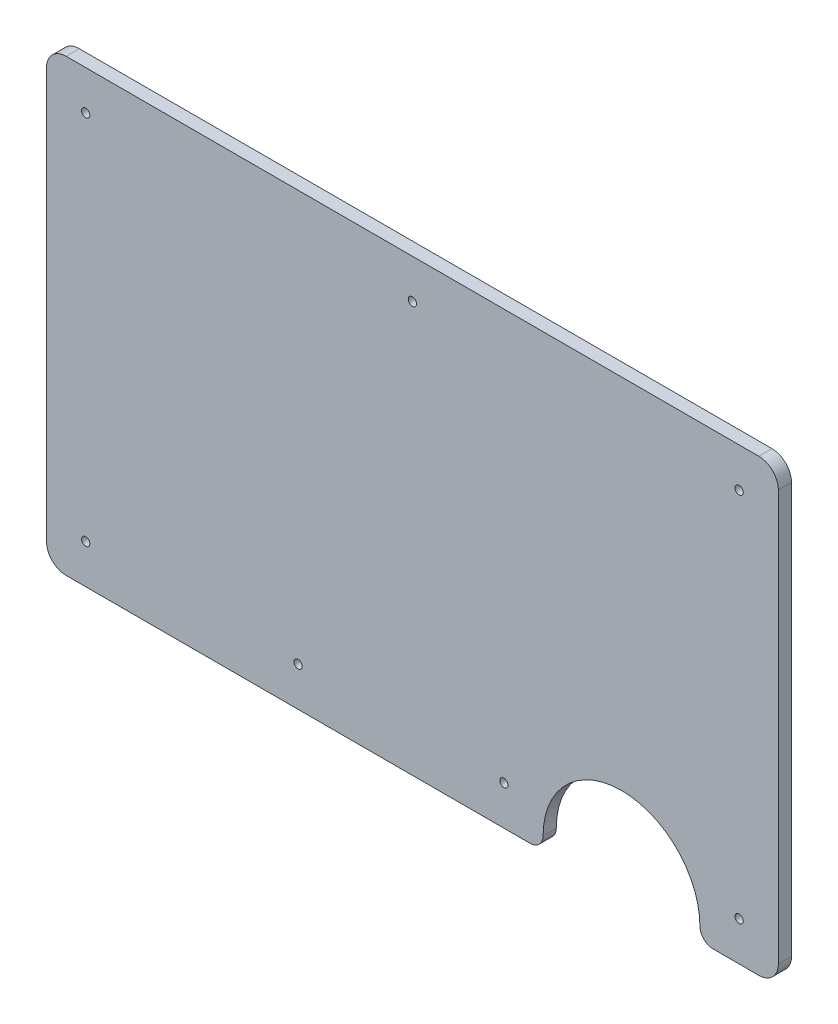
ISO-10303-21;
HEADER;
FILE_DESCRIPTION(('STEP AP214'),'2;1');
FILE_NAME('part.step','',(''),(''),'','','');
FILE_SCHEMA(('AUTOMOTIVE_DESIGN { 1 0 10303 214 1 1 1 1 }'));
ENDSEC;
DATA;
#1=APPLICATION_CONTEXT('core data for automotive mechanical design processes');
#2=APPLICATION_PROTOCOL_DEFINITION('international standard','automotive_design',2000,#1);
#3=PRODUCT_CONTEXT('',#1,'mechanical');
#4=PRODUCT('Part','Part','',(#3));
#5=PRODUCT_RELATED_PRODUCT_CATEGORY('part','',(#4));
#6=PRODUCT_DEFINITION_FORMATION('','',#4);
#7=PRODUCT_DEFINITION_CONTEXT('part definition',#1,'design');
#8=PRODUCT_DEFINITION('design','',#6,#7);
#9=PRODUCT_DEFINITION_SHAPE('','',#8);
#10=(LENGTH_UNIT() NAMED_UNIT(*) SI_UNIT(.MILLI.,.METRE.));
#11=(NAMED_UNIT(*) PLANE_ANGLE_UNIT() SI_UNIT($,.RADIAN.));
#12=(NAMED_UNIT(*) SI_UNIT($,.STERADIAN.) SOLID_ANGLE_UNIT());
#13=UNCERTAINTY_MEASURE_WITH_UNIT(LENGTH_MEASURE(1.E-05),#10,'distance_accuracy_value','');
#14=(GEOMETRIC_REPRESENTATION_CONTEXT(3) GLOBAL_UNCERTAINTY_ASSIGNED_CONTEXT((#13)) GLOBAL_UNIT_ASSIGNED_CONTEXT((#10,
#11,#12)) REPRESENTATION_CONTEXT('',''));
#15=CARTESIAN_POINT('',(0.,0.,0.));
#16=DIRECTION('',(0.,0.,1.));
#17=DIRECTION('',(1.,0.,0.));
#18=AXIS2_PLACEMENT_3D('',#15,#16,#17);
#19=CARTESIAN_POINT('',(2.38125,53.320743495935,0.));
#20=DIRECTION('',(0.,0.,1.));
#21=DIRECTION('',(1.,0.,0.));
#22=AXIS2_PLACEMENT_3D('',#19,#20,#21);
#23=CYLINDRICAL_SURFACE('',#22,2.38125);
#24=CARTESIAN_POINT('',(2.38125,53.320743495935,1.6));
#25=DIRECTION('',(0.,0.,1.));
#26=DIRECTION('',(1.,0.,0.));
#27=AXIS2_PLACEMENT_3D('',#24,#25,#26);
#28=CIRCLE('',#27,2.38125);
#29=CARTESIAN_POINT('',(2.38125,55.7019934959349,1.6));
#30=VERTEX_POINT('',#29);
#31=CARTESIAN_POINT('',(0.,53.320743495935,1.6));
#32=VERTEX_POINT('',#31);
#33=EDGE_CURVE('E157',#30,#32,#28,.T.);
#34=ORIENTED_EDGE('',*,*,#33,.F.);
#35=DIRECTION('',(0.,0.,1.));
#36=VECTOR('',#35,1.);
#37=CARTESIAN_POINT('',(2.38125,55.7019934959349,0.));
#38=LINE('',#37,#36);
#39=CARTESIAN_POINT('',(2.38125,55.7019934959349,0.));
#40=VERTEX_POINT('',#39);
#41=EDGE_CURVE('E11',#40,#30,#38,.T.);
#42=ORIENTED_EDGE('',*,*,#41,.F.);
#43=CARTESIAN_POINT('',(2.38125,53.320743495935,0.));
#44=DIRECTION('',(0.,0.,1.));
#45=DIRECTION('',(1.,0.,0.));
#46=AXIS2_PLACEMENT_3D('',#43,#44,#45);
#47=CIRCLE('',#46,2.38125);
#48=CARTESIAN_POINT('',(0.,53.320743495935,0.));
#49=VERTEX_POINT('',#48);
#50=EDGE_CURVE('E190',#40,#49,#47,.T.);
#51=ORIENTED_EDGE('',*,*,#50,.T.);
#52=DIRECTION('',(0.,0.,1.));
#53=VECTOR('',#52,1.);
#54=CARTESIAN_POINT('',(0.,53.320743495935,0.));
#55=LINE('',#54,#53);
#56=EDGE_CURVE('E39',#49,#32,#55,.T.);
#57=ORIENTED_EDGE('',*,*,#56,.T.);
#58=EDGE_LOOP('',(#34,#42,#51,#57));
#59=FACE_BOUND('',#58,.T.);
#60=ADVANCED_FACE('F36',(#59),#23,.T.);
#61=CARTESIAN_POINT('',(86.51875,55.7019934959349,0.));
#62=DIRECTION('',(0.,1.,0.));
#63=DIRECTION('',(0.,0.,1.));
#64=AXIS2_PLACEMENT_3D('',#61,#62,#63);
#65=PLANE('',#64);
#66=DIRECTION('',(-1.,0.,0.));
#67=VECTOR('',#66,1.);
#68=CARTESIAN_POINT('',(86.51875,55.7019934959349,1.6));
#69=LINE('',#68,#67);
#70=CARTESIAN_POINT('',(86.51875,55.7019934959349,1.6));
#71=VERTEX_POINT('',#70);
#72=EDGE_CURVE('E188',#71,#30,#69,.T.);
#73=ORIENTED_EDGE('',*,*,#72,.F.);
#74=DIRECTION('',(0.,0.,1.));
#75=VECTOR('',#74,1.);
#76=CARTESIAN_POINT('',(86.51875,55.7019934959349,0.));
#77=LINE('',#76,#75);
#78=CARTESIAN_POINT('',(86.51875,55.7019934959349,0.));
#79=VERTEX_POINT('',#78);
#80=EDGE_CURVE('E45',#79,#71,#77,.T.);
#81=ORIENTED_EDGE('',*,*,#80,.F.);
#82=DIRECTION('',(-1.,0.,0.));
#83=VECTOR('',#82,1.);
#84=CARTESIAN_POINT('',(86.51875,55.7019934959349,0.));
#85=LINE('',#84,#83);
#86=EDGE_CURVE('E147',#79,#40,#85,.T.);
#87=ORIENTED_EDGE('',*,*,#86,.T.);
#88=ORIENTED_EDGE('',*,*,#41,.T.);
#89=EDGE_LOOP('',(#73,#81,#87,#88));
#90=FACE_BOUND('',#89,.T.);
#91=ADVANCED_FACE('F210',(#90),#65,.T.);
#92=CARTESIAN_POINT('',(86.51875,53.320743495935,0.));
#93=DIRECTION('',(0.,0.,1.));
#94=DIRECTION('',(1.,0.,0.));
#95=AXIS2_PLACEMENT_3D('',#92,#93,#94);
#96=CYLINDRICAL_SURFACE('',#95,2.38125);
#97=CARTESIAN_POINT('',(86.51875,53.320743495935,1.6));
#98=DIRECTION('',(0.,0.,1.));
#99=DIRECTION('',(1.,0.,0.));
#100=AXIS2_PLACEMENT_3D('',#97,#98,#99);
#101=CIRCLE('',#100,2.38125);
#102=CARTESIAN_POINT('',(88.9,53.320743495935,1.6));
#103=VERTEX_POINT('',#102);
#104=EDGE_CURVE('E134',#103,#71,#101,.T.);
#105=ORIENTED_EDGE('',*,*,#104,.F.);
#106=DIRECTION('',(0.,0.,1.));
#107=VECTOR('',#106,1.);
#108=CARTESIAN_POINT('',(88.9,53.320743495935,0.));
#109=LINE('',#108,#107);
#110=CARTESIAN_POINT('',(88.9,53.320743495935,0.));
#111=VERTEX_POINT('',#110);
#112=EDGE_CURVE('E129',#111,#103,#109,.T.);
#113=ORIENTED_EDGE('',*,*,#112,.F.);
#114=CARTESIAN_POINT('',(86.51875,53.320743495935,0.));
#115=DIRECTION('',(0.,0.,1.));
#116=DIRECTION('',(1.,0.,0.));
#117=AXIS2_PLACEMENT_3D('',#114,#115,#116);
#118=CIRCLE('',#117,2.38125);
#119=EDGE_CURVE('E132',#111,#79,#118,.T.);
#120=ORIENTED_EDGE('',*,*,#119,.T.);
#121=ORIENTED_EDGE('',*,*,#80,.T.);
#122=EDGE_LOOP('',(#105,#113,#120,#121));
#123=FACE_BOUND('',#122,.T.);
#124=ADVANCED_FACE('F131',(#123),#96,.T.);
#125=CARTESIAN_POINT('',(88.9,3.47324349593496,0.));
#126=DIRECTION('',(1.,0.,0.));
#127=DIRECTION('',(0.,0.,-1.));
#128=AXIS2_PLACEMENT_3D('',#125,#126,#127);
#129=PLANE('',#128);
#130=DIRECTION('',(0.,1.,0.));
#131=VECTOR('',#130,1.);
#132=CARTESIAN_POINT('',(88.9,3.47324349593496,1.6));
#133=LINE('',#132,#131);
#134=CARTESIAN_POINT('',(88.9,3.47324349593496,1.6));
#135=VERTEX_POINT('',#134);
#136=EDGE_CURVE('E185',#135,#103,#133,.T.);
#137=ORIENTED_EDGE('',*,*,#136,.F.);
#138=DIRECTION('',(0.,0.,1.));
#139=VECTOR('',#138,1.);
#140=CARTESIAN_POINT('',(88.9,3.47324349593496,0.));
#141=LINE('',#140,#139);
#142=CARTESIAN_POINT('',(88.9,3.47324349593496,0.));
#143=VERTEX_POINT('',#142);
#144=EDGE_CURVE('E139',#143,#135,#141,.T.);
#145=ORIENTED_EDGE('',*,*,#144,.F.);
#146=DIRECTION('',(0.,1.,0.));
#147=VECTOR('',#146,1.);
#148=CARTESIAN_POINT('',(88.9,3.47324349593496,0.));
#149=LINE('',#148,#147);
#150=EDGE_CURVE('E145',#143,#111,#149,.T.);
#151=ORIENTED_EDGE('',*,*,#150,.T.);
#152=ORIENTED_EDGE('',*,*,#112,.T.);
#153=EDGE_LOOP('',(#137,#145,#151,#152));
#154=FACE_BOUND('',#153,.T.);
#155=ADVANCED_FACE('F149',(#154),#129,.T.);
#156=CARTESIAN_POINT('',(86.51875,3.47324349593496,0.));
#157=DIRECTION('',(0.,0.,1.));
#158=DIRECTION('',(1.,0.,0.));
#159=AXIS2_PLACEMENT_3D('',#156,#157,#158);
#160=CYLINDRICAL_SURFACE('',#159,2.38125);
#161=CARTESIAN_POINT('',(86.51875,3.47324349593496,1.6));
#162=DIRECTION('',(0.,0.,1.));
#163=DIRECTION('',(1.,0.,0.));
#164=AXIS2_PLACEMENT_3D('',#161,#162,#163);
#165=CIRCLE('',#164,2.38125);
#166=CARTESIAN_POINT('',(86.51875,1.09199349593496,1.6));
#167=VERTEX_POINT('',#166);
#168=EDGE_CURVE('E182',#167,#135,#165,.T.);
#169=ORIENTED_EDGE('',*,*,#168,.F.);
#170=DIRECTION('',(0.,0.,1.));
#171=VECTOR('',#170,1.);
#172=CARTESIAN_POINT('',(86.51875,1.09199349593496,0.));
#173=LINE('',#172,#171);
#174=CARTESIAN_POINT('',(86.51875,1.09199349593496,0.));
#175=VERTEX_POINT('',#174);
#176=EDGE_CURVE('E194',#175,#167,#173,.T.);
#177=ORIENTED_EDGE('',*,*,#176,.F.);
#178=CARTESIAN_POINT('',(86.51875,3.47324349593496,0.));
#179=DIRECTION('',(0.,0.,1.));
#180=DIRECTION('',(1.,0.,0.));
#181=AXIS2_PLACEMENT_3D('',#178,#179,#180);
#182=CIRCLE('',#181,2.38125);
#183=EDGE_CURVE('E150',#175,#143,#182,.T.);
#184=ORIENTED_EDGE('',*,*,#183,.T.);
#185=ORIENTED_EDGE('',*,*,#144,.T.);
#186=EDGE_LOOP('',(#169,#177,#184,#185));
#187=FACE_BOUND('',#186,.T.);
#188=ADVANCED_FACE('F223',(#187),#160,.T.);
#189=CARTESIAN_POINT('',(80.9625,1.09199349593496,0.));
#190=DIRECTION('',(0.,-1.,0.));
#191=DIRECTION('',(0.,0.,-1.));
#192=AXIS2_PLACEMENT_3D('',#189,#190,#191);
#193=PLANE('',#192);
#194=DIRECTION('',(1.,0.,0.));
#195=VECTOR('',#194,1.);
#196=CARTESIAN_POINT('',(80.9625,1.09199349593496,1.6));
#197=LINE('',#196,#195);
#198=CARTESIAN_POINT('',(80.9625,1.09199349593496,1.6));
#199=VERTEX_POINT('',#198);
#200=EDGE_CURVE('E179',#199,#167,#197,.T.);
#201=ORIENTED_EDGE('',*,*,#200,.F.);
#202=DIRECTION('',(0.,0.,1.));
#203=VECTOR('',#202,1.);
#204=CARTESIAN_POINT('',(80.9625,1.09199349593496,0.));
#205=LINE('',#204,#203);
#206=CARTESIAN_POINT('',(80.9625,1.09199349593496,0.));
#207=VERTEX_POINT('',#206);
#208=EDGE_CURVE('E196',#207,#199,#205,.T.);
#209=ORIENTED_EDGE('',*,*,#208,.F.);
#210=DIRECTION('',(1.,0.,0.));
#211=VECTOR('',#210,1.);
#212=CARTESIAN_POINT('',(80.9625,1.09199349593496,0.));
#213=LINE('',#212,#211);
#214=EDGE_CURVE('E152',#207,#175,#213,.T.);
#215=ORIENTED_EDGE('',*,*,#214,.T.);
#216=ORIENTED_EDGE('',*,*,#176,.T.);
#217=EDGE_LOOP('',(#201,#209,#215,#216));
#218=FACE_BOUND('',#217,.T.);
#219=ADVANCED_FACE('F226',(#218),#193,.T.);
#220=CARTESIAN_POINT('',(80.9625,2.67949349593496,0.));
#221=DIRECTION('',(0.,0.,1.));
#222=DIRECTION('',(1.,0.,0.));
#223=AXIS2_PLACEMENT_3D('',#220,#221,#222);
#224=CYLINDRICAL_SURFACE('',#223,1.5875);
#225=CARTESIAN_POINT('',(80.9625,2.67949349593496,1.6));
#226=DIRECTION('',(0.,0.,1.));
#227=DIRECTION('',(1.,0.,0.));
#228=AXIS2_PLACEMENT_3D('',#225,#226,#227);
#229=CIRCLE('',#228,1.5875);
#230=CARTESIAN_POINT('',(79.375,2.67949349593496,1.6));
#231=VERTEX_POINT('',#230);
#232=EDGE_CURVE('E176',#231,#199,#229,.T.);
#233=ORIENTED_EDGE('',*,*,#232,.F.);
#234=DIRECTION('',(0.,0.,1.));
#235=VECTOR('',#234,1.);
#236=CARTESIAN_POINT('',(79.375,2.67949349593496,0.));
#237=LINE('',#236,#235);
#238=CARTESIAN_POINT('',(79.375,2.67949349593496,0.));
#239=VERTEX_POINT('',#238);
#240=EDGE_CURVE('E198',#239,#231,#237,.T.);
#241=ORIENTED_EDGE('',*,*,#240,.F.);
#242=CARTESIAN_POINT('',(80.9625,2.67949349593496,0.));
#243=DIRECTION('',(0.,0.,1.));
#244=DIRECTION('',(1.,0.,0.));
#245=AXIS2_PLACEMENT_3D('',#242,#243,#244);
#246=CIRCLE('',#245,1.5875);
#247=EDGE_CURVE('E350',#239,#207,#246,.T.);
#248=ORIENTED_EDGE('',*,*,#247,.T.);
#249=ORIENTED_EDGE('',*,*,#208,.T.);
#250=EDGE_LOOP('',(#233,#241,#248,#249));
#251=FACE_BOUND('',#250,.T.);
#252=ADVANCED_FACE('F230',(#251),#224,.T.);
#253=CARTESIAN_POINT('',(69.85,2.67949349593496,0.));
#254=DIRECTION('',(0.,0.,1.));
#255=DIRECTION('',(1.,0.,0.));
#256=AXIS2_PLACEMENT_3D('',#253,#254,#255);
#257=CYLINDRICAL_SURFACE('',#256,9.525);
#258=CARTESIAN_POINT('',(69.85,2.67949349593496,1.6));
#259=DIRECTION('',(0.,0.,-1.));
#260=DIRECTION('',(-1.,0.,0.));
#261=AXIS2_PLACEMENT_3D('',#258,#259,#260);
#262=CIRCLE('',#261,9.525);
#263=CARTESIAN_POINT('',(60.325,2.67949349593496,1.6));
#264=VERTEX_POINT('',#263);
#265=EDGE_CURVE('E173',#264,#231,#262,.T.);
#266=ORIENTED_EDGE('',*,*,#265,.F.);
#267=DIRECTION('',(0.,0.,1.));
#268=VECTOR('',#267,1.);
#269=CARTESIAN_POINT('',(60.325,2.67949349593496,0.));
#270=LINE('',#269,#268);
#271=CARTESIAN_POINT('',(60.325,2.67949349593496,0.));
#272=VERTEX_POINT('',#271);
#273=EDGE_CURVE('E200',#272,#264,#270,.T.);
#274=ORIENTED_EDGE('',*,*,#273,.F.);
#275=CARTESIAN_POINT('',(69.85,2.67949349593496,0.));
#276=DIRECTION('',(0.,0.,-1.));
#277=DIRECTION('',(-1.,0.,0.));
#278=AXIS2_PLACEMENT_3D('',#275,#276,#277);
#279=CIRCLE('',#278,9.525);
#280=EDGE_CURVE('E347',#272,#239,#279,.T.);
#281=ORIENTED_EDGE('',*,*,#280,.T.);
#282=ORIENTED_EDGE('',*,*,#240,.T.);
#283=EDGE_LOOP('',(#266,#274,#281,#282));
#284=FACE_BOUND('',#283,.T.);
#285=ADVANCED_FACE('F234',(#284),#257,.F.);
#286=CARTESIAN_POINT('',(58.7375,2.67949349593496,0.));
#287=DIRECTION('',(0.,0.,1.));
#288=DIRECTION('',(1.,0.,0.));
#289=AXIS2_PLACEMENT_3D('',#286,#287,#288);
#290=CYLINDRICAL_SURFACE('',#289,1.5875);
#291=CARTESIAN_POINT('',(58.7375,2.67949349593496,1.6));
#292=DIRECTION('',(0.,0.,1.));
#293=DIRECTION('',(1.,0.,0.));
#294=AXIS2_PLACEMENT_3D('',#291,#292,#293);
#295=CIRCLE('',#294,1.5875);
#296=CARTESIAN_POINT('',(58.7375,1.09199349593496,1.6));
#297=VERTEX_POINT('',#296);
#298=EDGE_CURVE('E170',#297,#264,#295,.T.);
#299=ORIENTED_EDGE('',*,*,#298,.F.);
#300=DIRECTION('',(0.,0.,1.));
#301=VECTOR('',#300,1.);
#302=CARTESIAN_POINT('',(58.7375,1.09199349593496,0.));
#303=LINE('',#302,#301);
#304=CARTESIAN_POINT('',(58.7375,1.09199349593496,0.));
#305=VERTEX_POINT('',#304);
#306=EDGE_CURVE('E202',#305,#297,#303,.T.);
#307=ORIENTED_EDGE('',*,*,#306,.F.);
#308=CARTESIAN_POINT('',(58.7375,2.67949349593496,0.));
#309=DIRECTION('',(0.,0.,1.));
#310=DIRECTION('',(1.,0.,0.));
#311=AXIS2_PLACEMENT_3D('',#308,#309,#310);
#312=CIRCLE('',#311,1.5875);
#313=EDGE_CURVE('E344',#305,#272,#312,.T.);
#314=ORIENTED_EDGE('',*,*,#313,.T.);
#315=ORIENTED_EDGE('',*,*,#273,.T.);
#316=EDGE_LOOP('',(#299,#307,#314,#315));
#317=FACE_BOUND('',#316,.T.);
#318=ADVANCED_FACE('F238',(#317),#290,.T.);
#319=CARTESIAN_POINT('',(2.38125,1.09199349593496,0.));
#320=DIRECTION('',(0.,-1.,0.));
#321=DIRECTION('',(0.,0.,-1.));
#322=AXIS2_PLACEMENT_3D('',#319,#320,#321);
#323=PLANE('',#322);
#324=DIRECTION('',(1.,0.,0.));
#325=VECTOR('',#324,1.);
#326=CARTESIAN_POINT('',(2.38125,1.09199349593496,1.6));
#327=LINE('',#326,#325);
#328=CARTESIAN_POINT('',(2.38125,1.09199349593496,1.6));
#329=VERTEX_POINT('',#328);
#330=EDGE_CURVE('E167',#329,#297,#327,.T.);
#331=ORIENTED_EDGE('',*,*,#330,.F.);
#332=DIRECTION('',(0.,0.,1.));
#333=VECTOR('',#332,1.);
#334=CARTESIAN_POINT('',(2.38125,1.09199349593496,0.));
#335=LINE('',#334,#333);
#336=CARTESIAN_POINT('',(2.38125,1.09199349593496,0.));
#337=VERTEX_POINT('',#336);
#338=EDGE_CURVE('E204',#337,#329,#335,.T.);
#339=ORIENTED_EDGE('',*,*,#338,.F.);
#340=DIRECTION('',(1.,0.,0.));
#341=VECTOR('',#340,1.);
#342=CARTESIAN_POINT('',(2.38125,1.09199349593496,0.));
#343=LINE('',#342,#341);
#344=EDGE_CURVE('E341',#337,#305,#343,.T.);
#345=ORIENTED_EDGE('',*,*,#344,.T.);
#346=ORIENTED_EDGE('',*,*,#306,.T.);
#347=EDGE_LOOP('',(#331,#339,#345,#346));
#348=FACE_BOUND('',#347,.T.);
#349=ADVANCED_FACE('F242',(#348),#323,.T.);
#350=CARTESIAN_POINT('',(2.38125,3.47324349593496,0.));
#351=DIRECTION('',(0.,0.,1.));
#352=DIRECTION('',(1.,0.,0.));
#353=AXIS2_PLACEMENT_3D('',#350,#351,#352);
#354=CYLINDRICAL_SURFACE('',#353,2.38125);
#355=CARTESIAN_POINT('',(2.38125,3.47324349593496,1.6));
#356=DIRECTION('',(0.,0.,1.));
#357=DIRECTION('',(1.,0.,0.));
#358=AXIS2_PLACEMENT_3D('',#355,#356,#357);
#359=CIRCLE('',#358,2.38125);
#360=CARTESIAN_POINT('',(0.,3.47324349593496,1.6));
#361=VERTEX_POINT('',#360);
#362=EDGE_CURVE('E164',#361,#329,#359,.T.);
#363=ORIENTED_EDGE('',*,*,#362,.F.);
#364=DIRECTION('',(0.,0.,1.));
#365=VECTOR('',#364,1.);
#366=CARTESIAN_POINT('',(0.,3.47324349593496,0.));
#367=LINE('',#366,#365);
#368=CARTESIAN_POINT('',(0.,3.47324349593496,0.));
#369=VERTEX_POINT('',#368);
#370=EDGE_CURVE('E205',#369,#361,#367,.T.);
#371=ORIENTED_EDGE('',*,*,#370,.F.);
#372=CARTESIAN_POINT('',(2.38125,3.47324349593496,0.));
#373=DIRECTION('',(0.,0.,1.));
#374=DIRECTION('',(1.,0.,0.));
#375=AXIS2_PLACEMENT_3D('',#372,#373,#374);
#376=CIRCLE('',#375,2.38125);
#377=EDGE_CURVE('E338',#369,#337,#376,.T.);
#378=ORIENTED_EDGE('',*,*,#377,.T.);
#379=ORIENTED_EDGE('',*,*,#338,.T.);
#380=EDGE_LOOP('',(#363,#371,#378,#379));
#381=FACE_BOUND('',#380,.T.);
#382=ADVANCED_FACE('F246',(#381),#354,.T.);
#383=CARTESIAN_POINT('',(0.,53.320743495935,0.));
#384=DIRECTION('',(-1.,0.,0.));
#385=DIRECTION('',(0.,0.,1.));
#386=AXIS2_PLACEMENT_3D('',#383,#384,#385);
#387=PLANE('',#386);
#388=DIRECTION('',(0.,-1.,0.));
#389=VECTOR('',#388,1.);
#390=CARTESIAN_POINT('',(0.,53.320743495935,1.6));
#391=LINE('',#390,#389);
#392=EDGE_CURVE('E160',#32,#361,#391,.T.);
#393=ORIENTED_EDGE('',*,*,#392,.F.);
#394=ORIENTED_EDGE('',*,*,#56,.F.);
#395=DIRECTION('',(0.,-1.,0.));
#396=VECTOR('',#395,1.);
#397=CARTESIAN_POINT('',(0.,53.320743495935,0.));
#398=LINE('',#397,#396);
#399=EDGE_CURVE('E336',#49,#369,#398,.T.);
#400=ORIENTED_EDGE('',*,*,#399,.T.);
#401=ORIENTED_EDGE('',*,*,#370,.T.);
#402=EDGE_LOOP('',(#393,#394,#400,#401));
#403=FACE_BOUND('',#402,.T.);
#404=ADVANCED_FACE('F207',(#403),#387,.T.);
#405=CARTESIAN_POINT('',(2.38125,53.320743495935,0.));
#406=DIRECTION('',(0.,0.,1.));
#407=DIRECTION('',(1.,0.,0.));
#408=AXIS2_PLACEMENT_3D('',#405,#406,#407);
#409=PLANE('',#408);
#410=CARTESIAN_POINT('',(44.45,50.9394934959349,0.));
#411=DIRECTION('',(0.,0.,1.));
#412=DIRECTION('',(-1.,0.,0.));
#413=AXIS2_PLACEMENT_3D('',#410,#411,#412);
#414=CIRCLE('',#413,0.499999999999999);
#415=CARTESIAN_POINT('',(43.95,50.9394934959349,0.));
#416=VERTEX_POINT('',#415);
#417=EDGE_CURVE('E293',#416,#416,#414,.T.);
#418=ORIENTED_EDGE('',*,*,#417,.T.);
#419=EDGE_LOOP('',(#418));
#420=FACE_BOUND('',#419,.T.);
#421=CARTESIAN_POINT('',(55.5625,5.85449349593496,0.));
#422=DIRECTION('',(0.,0.,1.));
#423=DIRECTION('',(-1.,0.,0.));
#424=AXIS2_PLACEMENT_3D('',#421,#422,#423);
#425=CIRCLE('',#424,0.499999999999999);
#426=CARTESIAN_POINT('',(55.0625,5.85449349593496,0.));
#427=VERTEX_POINT('',#426);
#428=EDGE_CURVE('E301',#427,#427,#425,.T.);
#429=ORIENTED_EDGE('',*,*,#428,.T.);
#430=EDGE_LOOP('',(#429));
#431=FACE_BOUND('',#430,.T.);
#432=CARTESIAN_POINT('',(30.559375,5.85449349593495,0.));
#433=DIRECTION('',(0.,0.,1.));
#434=DIRECTION('',(-1.,0.,0.));
#435=AXIS2_PLACEMENT_3D('',#432,#433,#434);
#436=CIRCLE('',#435,0.499999999999999);
#437=CARTESIAN_POINT('',(30.059375,5.85449349593495,0.));
#438=VERTEX_POINT('',#437);
#439=EDGE_CURVE('E307',#438,#438,#436,.T.);
#440=ORIENTED_EDGE('',*,*,#439,.T.);
#441=EDGE_LOOP('',(#440));
#442=FACE_BOUND('',#441,.T.);
#443=CARTESIAN_POINT('',(84.1375,50.9394934959349,0.));
#444=DIRECTION('',(0.,0.,1.));
#445=DIRECTION('',(-1.,0.,0.));
#446=AXIS2_PLACEMENT_3D('',#443,#444,#445);
#447=CIRCLE('',#446,0.499999999999999);
#448=CARTESIAN_POINT('',(83.6375,50.9394934959349,0.));
#449=VERTEX_POINT('',#448);
#450=EDGE_CURVE('E313',#449,#449,#447,.T.);
#451=ORIENTED_EDGE('',*,*,#450,.T.);
#452=EDGE_LOOP('',(#451));
#453=FACE_BOUND('',#452,.T.);
#454=CARTESIAN_POINT('',(84.1375,5.85449349593496,0.));
#455=DIRECTION('',(0.,0.,1.));
#456=DIRECTION('',(-1.,0.,0.));
#457=AXIS2_PLACEMENT_3D('',#454,#455,#456);
#458=CIRCLE('',#457,0.499999999999999);
#459=CARTESIAN_POINT('',(83.6375,5.85449349593496,0.));
#460=VERTEX_POINT('',#459);
#461=EDGE_CURVE('E319',#460,#460,#458,.T.);
#462=ORIENTED_EDGE('',*,*,#461,.T.);
#463=EDGE_LOOP('',(#462));
#464=FACE_BOUND('',#463,.T.);
#465=CARTESIAN_POINT('',(4.7625,5.85449349593496,0.));
#466=DIRECTION('',(0.,0.,1.));
#467=DIRECTION('',(-1.,0.,0.));
#468=AXIS2_PLACEMENT_3D('',#465,#466,#467);
#469=CIRCLE('',#468,0.5);
#470=CARTESIAN_POINT('',(4.2625,5.85449349593496,0.));
#471=VERTEX_POINT('',#470);
#472=EDGE_CURVE('E325',#471,#471,#469,.T.);
#473=ORIENTED_EDGE('',*,*,#472,.T.);
#474=EDGE_LOOP('',(#473));
#475=FACE_BOUND('',#474,.T.);
#476=CARTESIAN_POINT('',(4.7625,50.9394934959349,0.));
#477=DIRECTION('',(0.,0.,1.));
#478=DIRECTION('',(-1.,0.,0.));
#479=AXIS2_PLACEMENT_3D('',#476,#477,#478);
#480=CIRCLE('',#479,0.5);
#481=CARTESIAN_POINT('',(4.2625,50.9394934959349,0.));
#482=VERTEX_POINT('',#481);
#483=EDGE_CURVE('E161',#482,#482,#480,.T.);
#484=ORIENTED_EDGE('',*,*,#483,.T.);
#485=EDGE_LOOP('',(#484));
#486=FACE_BOUND('',#485,.T.);
#487=ORIENTED_EDGE('',*,*,#50,.F.);
#488=ORIENTED_EDGE('',*,*,#86,.F.);
#489=ORIENTED_EDGE('',*,*,#119,.F.);
#490=ORIENTED_EDGE('',*,*,#150,.F.);
#491=ORIENTED_EDGE('',*,*,#183,.F.);
#492=ORIENTED_EDGE('',*,*,#214,.F.);
#493=ORIENTED_EDGE('',*,*,#247,.F.);
#494=ORIENTED_EDGE('',*,*,#280,.F.);
#495=ORIENTED_EDGE('',*,*,#313,.F.);
#496=ORIENTED_EDGE('',*,*,#344,.F.);
#497=ORIENTED_EDGE('',*,*,#377,.F.);
#498=ORIENTED_EDGE('',*,*,#399,.F.);
#499=EDGE_LOOP('',(#487,#488,#489,#490,#491,#492,#493,#494,#495,#496,#497,#498));
#500=FACE_BOUND('',#499,.T.);
#501=ADVANCED_FACE('F143',(#420,#431,#442,#453,#464,#475,#486,#500),#409,.F.);
#502=CARTESIAN_POINT('',(2.38125,53.320743495935,1.6));
#503=DIRECTION('',(0.,0.,1.));
#504=DIRECTION('',(1.,0.,0.));
#505=AXIS2_PLACEMENT_3D('',#502,#503,#504);
#506=PLANE('',#505);
#507=CARTESIAN_POINT('',(44.45,50.9394934959349,1.6));
#508=DIRECTION('',(0.,0.,1.));
#509=DIRECTION('',(-1.,0.,0.));
#510=AXIS2_PLACEMENT_3D('',#507,#508,#509);
#511=CIRCLE('',#510,0.499999999999999);
#512=CARTESIAN_POINT('',(43.95,50.9394934959349,1.6));
#513=VERTEX_POINT('',#512);
#514=EDGE_CURVE('E296',#513,#513,#511,.T.);
#515=ORIENTED_EDGE('',*,*,#514,.F.);
#516=EDGE_LOOP('',(#515));
#517=FACE_BOUND('',#516,.T.);
#518=CARTESIAN_POINT('',(55.5625,5.85449349593496,1.6));
#519=DIRECTION('',(0.,0.,1.));
#520=DIRECTION('',(-1.,0.,0.));
#521=AXIS2_PLACEMENT_3D('',#518,#519,#520);
#522=CIRCLE('',#521,0.499999999999999);
#523=CARTESIAN_POINT('',(55.0625,5.85449349593496,1.6));
#524=VERTEX_POINT('',#523);
#525=EDGE_CURVE('E298',#524,#524,#522,.T.);
#526=ORIENTED_EDGE('',*,*,#525,.F.);
#527=EDGE_LOOP('',(#526));
#528=FACE_BOUND('',#527,.T.);
#529=CARTESIAN_POINT('',(30.559375,5.85449349593495,1.6));
#530=DIRECTION('',(0.,0.,1.));
#531=DIRECTION('',(-1.,0.,0.));
#532=AXIS2_PLACEMENT_3D('',#529,#530,#531);
#533=CIRCLE('',#532,0.499999999999999);
#534=CARTESIAN_POINT('',(30.059375,5.85449349593495,1.6));
#535=VERTEX_POINT('',#534);
#536=EDGE_CURVE('E304',#535,#535,#533,.T.);
#537=ORIENTED_EDGE('',*,*,#536,.F.);
#538=EDGE_LOOP('',(#537));
#539=FACE_BOUND('',#538,.T.);
#540=CARTESIAN_POINT('',(84.1375,50.9394934959349,1.6));
#541=DIRECTION('',(0.,0.,1.));
#542=DIRECTION('',(-1.,0.,0.));
#543=AXIS2_PLACEMENT_3D('',#540,#541,#542);
#544=CIRCLE('',#543,0.499999999999999);
#545=CARTESIAN_POINT('',(83.6375,50.9394934959349,1.6));
#546=VERTEX_POINT('',#545);
#547=EDGE_CURVE('E310',#546,#546,#544,.T.);
#548=ORIENTED_EDGE('',*,*,#547,.F.);
#549=EDGE_LOOP('',(#548));
#550=FACE_BOUND('',#549,.T.);
#551=CARTESIAN_POINT('',(84.1375,5.85449349593496,1.6));
#552=DIRECTION('',(0.,0.,1.));
#553=DIRECTION('',(-1.,0.,0.));
#554=AXIS2_PLACEMENT_3D('',#551,#552,#553);
#555=CIRCLE('',#554,0.499999999999999);
#556=CARTESIAN_POINT('',(83.6375,5.85449349593496,1.6));
#557=VERTEX_POINT('',#556);
#558=EDGE_CURVE('E316',#557,#557,#555,.T.);
#559=ORIENTED_EDGE('',*,*,#558,.F.);
#560=EDGE_LOOP('',(#559));
#561=FACE_BOUND('',#560,.T.);
#562=CARTESIAN_POINT('',(4.7625,5.85449349593496,1.6));
#563=DIRECTION('',(0.,0.,1.));
#564=DIRECTION('',(-1.,0.,0.));
#565=AXIS2_PLACEMENT_3D('',#562,#563,#564);
#566=CIRCLE('',#565,0.5);
#567=CARTESIAN_POINT('',(4.2625,5.85449349593496,1.6));
#568=VERTEX_POINT('',#567);
#569=EDGE_CURVE('E322',#568,#568,#566,.T.);
#570=ORIENTED_EDGE('',*,*,#569,.F.);
#571=EDGE_LOOP('',(#570));
#572=FACE_BOUND('',#571,.T.);
#573=CARTESIAN_POINT('',(4.7625,50.9394934959349,1.6));
#574=DIRECTION('',(0.,0.,1.));
#575=DIRECTION('',(-1.,0.,0.));
#576=AXIS2_PLACEMENT_3D('',#573,#574,#575);
#577=CIRCLE('',#576,0.5);
#578=CARTESIAN_POINT('',(4.2625,50.9394934959349,1.6));
#579=VERTEX_POINT('',#578);
#580=EDGE_CURVE('E328',#579,#579,#577,.T.);
#581=ORIENTED_EDGE('',*,*,#580,.F.);
#582=EDGE_LOOP('',(#581));
#583=FACE_BOUND('',#582,.T.);
#584=ORIENTED_EDGE('',*,*,#33,.T.);
#585=ORIENTED_EDGE('',*,*,#392,.T.);
#586=ORIENTED_EDGE('',*,*,#362,.T.);
#587=ORIENTED_EDGE('',*,*,#330,.T.);
#588=ORIENTED_EDGE('',*,*,#298,.T.);
#589=ORIENTED_EDGE('',*,*,#265,.T.);
#590=ORIENTED_EDGE('',*,*,#232,.T.);
#591=ORIENTED_EDGE('',*,*,#200,.T.);
#592=ORIENTED_EDGE('',*,*,#168,.T.);
#593=ORIENTED_EDGE('',*,*,#136,.T.);
#594=ORIENTED_EDGE('',*,*,#104,.T.);
#595=ORIENTED_EDGE('',*,*,#72,.T.);
#596=EDGE_LOOP('',(#584,#585,#586,#587,#588,#589,#590,#591,#592,#593,#594,#595));
#597=FACE_BOUND('',#596,.T.);
#598=ADVANCED_FACE('F209',(#517,#528,#539,#550,#561,#572,#583,#597),#506,.T.);
#599=CARTESIAN_POINT('',(4.7625,50.9394934959349,0.));
#600=DIRECTION('',(0.,0.,1.));
#601=DIRECTION('',(1.,0.,0.));
#602=AXIS2_PLACEMENT_3D('',#599,#600,#601);
#603=CYLINDRICAL_SURFACE('',#602,0.5);
#604=ORIENTED_EDGE('',*,*,#483,.F.);
#605=EDGE_LOOP('',(#604));
#606=FACE_BOUND('',#605,.T.);
#607=ORIENTED_EDGE('',*,*,#580,.T.);
#608=EDGE_LOOP('',(#607));
#609=FACE_BOUND('',#608,.T.);
#610=ADVANCED_FACE('F258',(#606,#609),#603,.F.);
#611=CARTESIAN_POINT('',(4.7625,5.85449349593496,0.));
#612=DIRECTION('',(0.,0.,1.));
#613=DIRECTION('',(1.,0.,0.));
#614=AXIS2_PLACEMENT_3D('',#611,#612,#613);
#615=CYLINDRICAL_SURFACE('',#614,0.5);
#616=ORIENTED_EDGE('',*,*,#472,.F.);
#617=EDGE_LOOP('',(#616));
#618=FACE_BOUND('',#617,.T.);
#619=ORIENTED_EDGE('',*,*,#569,.T.);
#620=EDGE_LOOP('',(#619));
#621=FACE_BOUND('',#620,.T.);
#622=ADVANCED_FACE('F265',(#618,#621),#615,.F.);
#623=CARTESIAN_POINT('',(84.1375,5.85449349593496,0.));
#624=DIRECTION('',(0.,0.,1.));
#625=DIRECTION('',(1.,0.,0.));
#626=AXIS2_PLACEMENT_3D('',#623,#624,#625);
#627=CYLINDRICAL_SURFACE('',#626,0.499999999999999);
#628=ORIENTED_EDGE('',*,*,#461,.F.);
#629=EDGE_LOOP('',(#628));
#630=FACE_BOUND('',#629,.T.);
#631=ORIENTED_EDGE('',*,*,#558,.T.);
#632=EDGE_LOOP('',(#631));
#633=FACE_BOUND('',#632,.T.);
#634=ADVANCED_FACE('F269',(#630,#633),#627,.F.);
#635=CARTESIAN_POINT('',(84.1375,50.9394934959349,0.));
#636=DIRECTION('',(0.,0.,1.));
#637=DIRECTION('',(1.,0.,0.));
#638=AXIS2_PLACEMENT_3D('',#635,#636,#637);
#639=CYLINDRICAL_SURFACE('',#638,0.499999999999999);
#640=ORIENTED_EDGE('',*,*,#450,.F.);
#641=EDGE_LOOP('',(#640));
#642=FACE_BOUND('',#641,.T.);
#643=ORIENTED_EDGE('',*,*,#547,.T.);
#644=EDGE_LOOP('',(#643));
#645=FACE_BOUND('',#644,.T.);
#646=ADVANCED_FACE('F273',(#642,#645),#639,.F.);
#647=CARTESIAN_POINT('',(30.559375,5.85449349593495,0.));
#648=DIRECTION('',(0.,0.,1.));
#649=DIRECTION('',(1.,0.,0.));
#650=AXIS2_PLACEMENT_3D('',#647,#648,#649);
#651=CYLINDRICAL_SURFACE('',#650,0.499999999999999);
#652=ORIENTED_EDGE('',*,*,#439,.F.);
#653=EDGE_LOOP('',(#652));
#654=FACE_BOUND('',#653,.T.);
#655=ORIENTED_EDGE('',*,*,#536,.T.);
#656=EDGE_LOOP('',(#655));
#657=FACE_BOUND('',#656,.T.);
#658=ADVANCED_FACE('F277',(#654,#657),#651,.F.);
#659=CARTESIAN_POINT('',(55.5625,5.85449349593496,0.));
#660=DIRECTION('',(0.,0.,1.));
#661=DIRECTION('',(1.,0.,0.));
#662=AXIS2_PLACEMENT_3D('',#659,#660,#661);
#663=CYLINDRICAL_SURFACE('',#662,0.499999999999999);
#664=ORIENTED_EDGE('',*,*,#428,.F.);
#665=EDGE_LOOP('',(#664));
#666=FACE_BOUND('',#665,.T.);
#667=ORIENTED_EDGE('',*,*,#525,.T.);
#668=EDGE_LOOP('',(#667));
#669=FACE_BOUND('',#668,.T.);
#670=ADVANCED_FACE('F281',(#666,#669),#663,.F.);
#671=CARTESIAN_POINT('',(44.45,50.9394934959349,0.));
#672=DIRECTION('',(0.,0.,1.));
#673=DIRECTION('',(1.,0.,0.));
#674=AXIS2_PLACEMENT_3D('',#671,#672,#673);
#675=CYLINDRICAL_SURFACE('',#674,0.499999999999999);
#676=ORIENTED_EDGE('',*,*,#417,.F.);
#677=EDGE_LOOP('',(#676));
#678=FACE_BOUND('',#677,.T.);
#679=ORIENTED_EDGE('',*,*,#514,.T.);
#680=EDGE_LOOP('',(#679));
#681=FACE_BOUND('',#680,.T.);
#682=ADVANCED_FACE('F285',(#678,#681),#675,.F.);
#683=CLOSED_SHELL('',(#60,#91,#124,#155,#188,#219,#252,#285,#318,#349,#382,#404,#501,#598,#610,
#622,#634,#646,#658,#670,#682));
#684=MANIFOLD_SOLID_BREP('B2',#683);
#685=ADVANCED_BREP_SHAPE_REPRESENTATION('',(#18,#684),#14);
#686=SHAPE_DEFINITION_REPRESENTATION(#9,#685);
ENDSEC;
END-ISO-10303-21;
